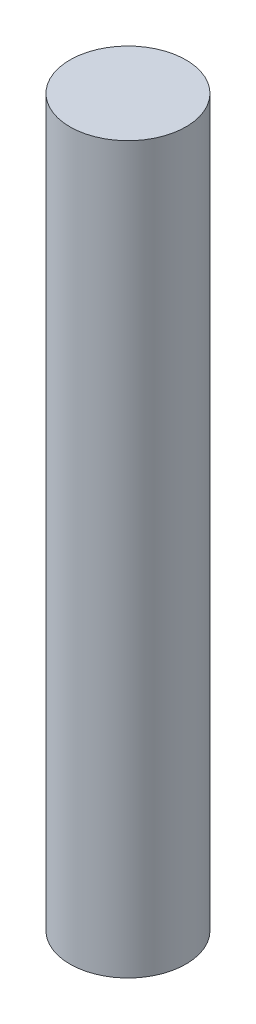
ISO-10303-21;
HEADER;
FILE_DESCRIPTION(('STEP AP214'),'2;1');
FILE_NAME('part.step','',(''),(''),'','','');
FILE_SCHEMA(('AUTOMOTIVE_DESIGN { 1 0 10303 214 1 1 1 1 }'));
ENDSEC;
DATA;
#1=APPLICATION_CONTEXT('core data for automotive mechanical design processes');
#2=APPLICATION_PROTOCOL_DEFINITION('international standard','automotive_design',2000,#1);
#3=PRODUCT_CONTEXT('',#1,'mechanical');
#4=PRODUCT('Part','Part','',(#3));
#5=PRODUCT_RELATED_PRODUCT_CATEGORY('part','',(#4));
#6=PRODUCT_DEFINITION_FORMATION('','',#4);
#7=PRODUCT_DEFINITION_CONTEXT('part definition',#1,'design');
#8=PRODUCT_DEFINITION('design','',#6,#7);
#9=PRODUCT_DEFINITION_SHAPE('','',#8);
#10=(LENGTH_UNIT() NAMED_UNIT(*) SI_UNIT(.MILLI.,.METRE.));
#11=(NAMED_UNIT(*) PLANE_ANGLE_UNIT() SI_UNIT($,.RADIAN.));
#12=(NAMED_UNIT(*) SI_UNIT($,.STERADIAN.) SOLID_ANGLE_UNIT());
#13=UNCERTAINTY_MEASURE_WITH_UNIT(LENGTH_MEASURE(1.E-05),#10,'distance_accuracy_value','');
#14=(GEOMETRIC_REPRESENTATION_CONTEXT(3) GLOBAL_UNCERTAINTY_ASSIGNED_CONTEXT((#13)) GLOBAL_UNIT_ASSIGNED_CONTEXT((#10,
#11,#12)) REPRESENTATION_CONTEXT('',''));
#15=CARTESIAN_POINT('',(0.,0.,0.));
#16=DIRECTION('',(0.,0.,1.));
#17=DIRECTION('',(1.,0.,0.));
#18=AXIS2_PLACEMENT_3D('',#15,#16,#17);
#19=CARTESIAN_POINT('',(0.,200.,0.));
#20=DIRECTION('',(0.,-1.,0.));
#21=DIRECTION('',(0.,0.,-1.));
#22=AXIS2_PLACEMENT_3D('',#19,#20,#21);
#23=CYLINDRICAL_SURFACE('',#22,16.);
#24=CARTESIAN_POINT('',(0.,200.,0.));
#25=DIRECTION('',(0.,1.,0.));
#26=DIRECTION('',(0.,0.,1.));
#27=AXIS2_PLACEMENT_3D('',#24,#25,#26);
#28=CIRCLE('',#27,16.);
#29=CARTESIAN_POINT('',(0.,200.,16.));
#30=VERTEX_POINT('',#29);
#31=EDGE_CURVE('E10',#30,#30,#28,.T.);
#32=ORIENTED_EDGE('',*,*,#31,.F.);
#33=EDGE_LOOP('',(#32));
#34=FACE_BOUND('',#33,.T.);
#35=CARTESIAN_POINT('',(0.,0.,0.));
#36=DIRECTION('',(0.,1.,0.));
#37=DIRECTION('',(0.,0.,1.));
#38=AXIS2_PLACEMENT_3D('',#35,#36,#37);
#39=CIRCLE('',#38,16.);
#40=CARTESIAN_POINT('',(0.,0.,16.));
#41=VERTEX_POINT('',#40);
#42=EDGE_CURVE('E34',#41,#41,#39,.T.);
#43=ORIENTED_EDGE('',*,*,#42,.T.);
#44=EDGE_LOOP('',(#43));
#45=FACE_BOUND('',#44,.T.);
#46=ADVANCED_FACE('F31',(#34,#45),#23,.T.);
#47=CARTESIAN_POINT('',(0.,200.,0.));
#48=DIRECTION('',(0.,1.,0.));
#49=DIRECTION('',(0.,0.,1.));
#50=AXIS2_PLACEMENT_3D('',#47,#48,#49);
#51=PLANE('',#50);
#52=ORIENTED_EDGE('',*,*,#31,.T.);
#53=EDGE_LOOP('',(#52));
#54=FACE_BOUND('',#53,.T.);
#55=ADVANCED_FACE('F46',(#54),#51,.T.);
#56=CARTESIAN_POINT('',(0.,0.,0.));
#57=DIRECTION('',(0.,1.,0.));
#58=DIRECTION('',(0.,0.,1.));
#59=AXIS2_PLACEMENT_3D('',#56,#57,#58);
#60=PLANE('',#59);
#61=ORIENTED_EDGE('',*,*,#42,.F.);
#62=EDGE_LOOP('',(#61));
#63=FACE_BOUND('',#62,.T.);
#64=ADVANCED_FACE('F44',(#63),#60,.F.);
#65=CLOSED_SHELL('',(#46,#55,#64));
#66=MANIFOLD_SOLID_BREP('B2',#65);
#67=ADVANCED_BREP_SHAPE_REPRESENTATION('',(#18,#66),#14);
#68=SHAPE_DEFINITION_REPRESENTATION(#9,#67);
ENDSEC;
END-ISO-10303-21;
